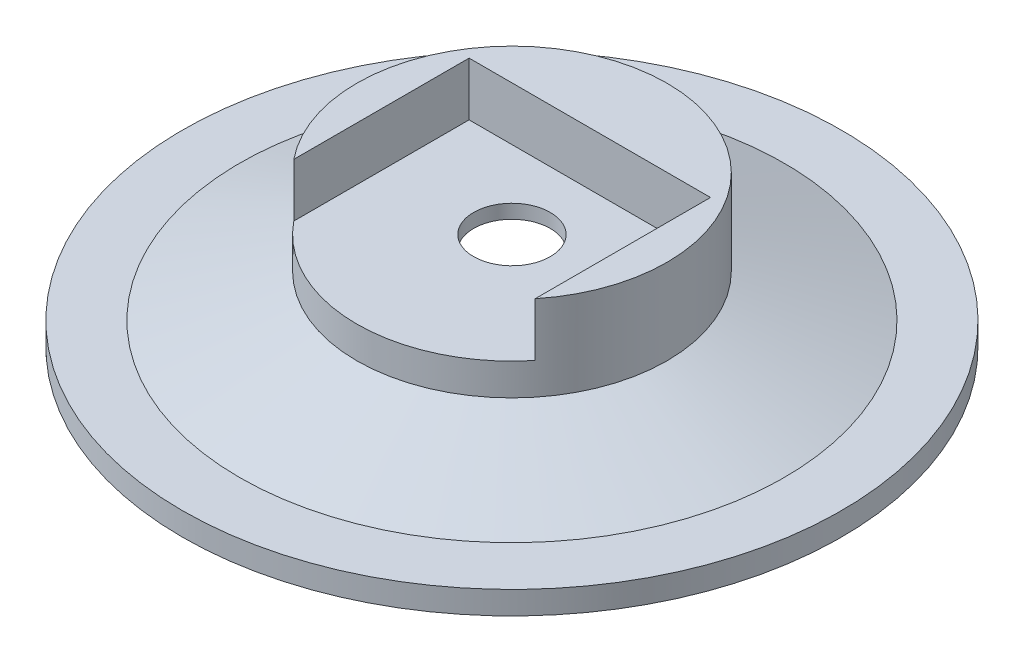
ISO-10303-21;
HEADER;
FILE_DESCRIPTION(('STEP AP214'),'2;1');
FILE_NAME('part.step','',(''),(''),'','','');
FILE_SCHEMA(('AUTOMOTIVE_DESIGN { 1 0 10303 214 1 1 1 1 }'));
ENDSEC;
DATA;
#1=APPLICATION_CONTEXT('core data for automotive mechanical design processes');
#2=APPLICATION_PROTOCOL_DEFINITION('international standard','automotive_design',2000,#1);
#3=PRODUCT_CONTEXT('',#1,'mechanical');
#4=PRODUCT('Part','Part','',(#3));
#5=PRODUCT_RELATED_PRODUCT_CATEGORY('part','',(#4));
#6=PRODUCT_DEFINITION_FORMATION('','',#4);
#7=PRODUCT_DEFINITION_CONTEXT('part definition',#1,'design');
#8=PRODUCT_DEFINITION('design','',#6,#7);
#9=PRODUCT_DEFINITION_SHAPE('','',#8);
#10=(LENGTH_UNIT() NAMED_UNIT(*) SI_UNIT(.MILLI.,.METRE.));
#11=(NAMED_UNIT(*) PLANE_ANGLE_UNIT() SI_UNIT($,.RADIAN.));
#12=(NAMED_UNIT(*) SI_UNIT($,.STERADIAN.) SOLID_ANGLE_UNIT());
#13=UNCERTAINTY_MEASURE_WITH_UNIT(LENGTH_MEASURE(1.E-05),#10,'distance_accuracy_value','');
#14=(GEOMETRIC_REPRESENTATION_CONTEXT(3) GLOBAL_UNCERTAINTY_ASSIGNED_CONTEXT((#13)) GLOBAL_UNIT_ASSIGNED_CONTEXT((#10,
#11,#12)) REPRESENTATION_CONTEXT('',''));
#15=CARTESIAN_POINT('',(0.,0.,0.));
#16=DIRECTION('',(0.,0.,1.));
#17=DIRECTION('',(1.,0.,0.));
#18=AXIS2_PLACEMENT_3D('',#15,#16,#17);
#19=CARTESIAN_POINT('',(0.,0.,0.));
#20=DIRECTION('',(0.,1.,0.));
#21=DIRECTION('',(0.,0.,1.));
#22=AXIS2_PLACEMENT_3D('',#19,#20,#21);
#23=CYLINDRICAL_SURFACE('',#22,2.5);
#24=CARTESIAN_POINT('',(0.,5.44285714285714,0.));
#25=DIRECTION('',(0.,1.,0.));
#26=DIRECTION('',(0.,0.,1.));
#27=AXIS2_PLACEMENT_3D('',#24,#25,#26);
#28=CIRCLE('',#27,2.5);
#29=CARTESIAN_POINT('',(0.,5.44285714285714,2.5));
#30=VERTEX_POINT('',#29);
#31=EDGE_CURVE('E117',#30,#30,#28,.T.);
#32=ORIENTED_EDGE('',*,*,#31,.F.);
#33=EDGE_LOOP('',(#32));
#34=FACE_BOUND('',#33,.T.);
#35=CARTESIAN_POINT('',(0.,6.35,0.));
#36=DIRECTION('',(0.,1.,0.));
#37=DIRECTION('',(0.,0.,1.));
#38=AXIS2_PLACEMENT_3D('',#35,#36,#37);
#39=CIRCLE('',#38,2.5);
#40=CARTESIAN_POINT('',(0.,6.35,2.5));
#41=VERTEX_POINT('',#40);
#42=EDGE_CURVE('E94',#41,#41,#39,.F.);
#43=ORIENTED_EDGE('',*,*,#42,.F.);
#44=EDGE_LOOP('',(#43));
#45=FACE_BOUND('',#44,.T.);
#46=ADVANCED_FACE('F34',(#34,#45),#23,.F.);
#47=CARTESIAN_POINT('',(17.5,0.,0.));
#48=DIRECTION('',(0.,1.,0.));
#49=DIRECTION('',(0.,0.,1.));
#50=AXIS2_PLACEMENT_3D('',#47,#48,#49);
#51=PLANE('',#50);
#52=CARTESIAN_POINT('',(0.,0.,0.));
#53=DIRECTION('',(0.,1.,0.));
#54=DIRECTION('',(0.,0.,1.));
#55=AXIS2_PLACEMENT_3D('',#52,#53,#54);
#56=CIRCLE('',#55,21.5);
#57=CARTESIAN_POINT('',(0.,0.,21.5));
#58=VERTEX_POINT('',#57);
#59=EDGE_CURVE('E102',#58,#58,#56,.T.);
#60=ORIENTED_EDGE('',*,*,#59,.F.);
#61=EDGE_LOOP('',(#60));
#62=FACE_BOUND('',#61,.T.);
#63=CARTESIAN_POINT('',(0.,0.,0.));
#64=DIRECTION('',(0.,1.,0.));
#65=DIRECTION('',(0.,0.,1.));
#66=AXIS2_PLACEMENT_3D('',#63,#64,#65);
#67=CIRCLE('',#66,17.5);
#68=CARTESIAN_POINT('',(0.,0.,17.5));
#69=VERTEX_POINT('',#68);
#70=EDGE_CURVE('E120',#69,#69,#67,.T.);
#71=ORIENTED_EDGE('',*,*,#70,.T.);
#72=EDGE_LOOP('',(#71));
#73=FACE_BOUND('',#72,.T.);
#74=ADVANCED_FACE('F36',(#62,#73),#51,.F.);
#75=CARTESIAN_POINT('',(0.,5.44285714285714,0.));
#76=DIRECTION('',(0.,-1.,0.));
#77=DIRECTION('',(0.,0.,-1.));
#78=AXIS2_PLACEMENT_3D('',#75,#76,#77);
#79=CONICAL_SURFACE('',#78,2.5,1.2227137122716);
#80=ORIENTED_EDGE('',*,*,#70,.F.);
#81=EDGE_LOOP('',(#80));
#82=FACE_BOUND('',#81,.T.);
#83=ORIENTED_EDGE('',*,*,#31,.T.);
#84=EDGE_LOOP('',(#83));
#85=FACE_BOUND('',#84,.T.);
#86=ADVANCED_FACE('F149',(#82,#85),#79,.F.);
#87=CARTESIAN_POINT('',(10.12,9.83949416342413,0.));
#88=DIRECTION('',(0.,-1.,0.));
#89=DIRECTION('',(0.,0.,-1.));
#90=AXIS2_PLACEMENT_3D('',#87,#88,#89);
#91=PLANE('',#90);
#92=DIRECTION('',(1.,0.,0.));
#93=VECTOR('',#92,1.);
#94=CARTESIAN_POINT('',(10.12,9.83949416342413,-5.08));
#95=LINE('',#94,#93);
#96=CARTESIAN_POINT('',(-7.874,9.83949416342413,-5.08));
#97=VERTEX_POINT('',#96);
#98=CARTESIAN_POINT('',(7.874,9.83949416342413,-5.08));
#99=VERTEX_POINT('',#98);
#100=EDGE_CURVE('E11',#97,#99,#95,.T.);
#101=ORIENTED_EDGE('',*,*,#100,.T.);
#102=DIRECTION('',(0.,0.,1.));
#103=VECTOR('',#102,1.);
#104=CARTESIAN_POINT('',(7.874,9.83949416342413,0.));
#105=LINE('',#104,#103);
#106=CARTESIAN_POINT('',(7.874,9.83949416342413,6.3572418547669));
#107=VERTEX_POINT('',#106);
#108=EDGE_CURVE('E85',#99,#107,#105,.T.);
#109=ORIENTED_EDGE('',*,*,#108,.T.);
#110=CARTESIAN_POINT('',(0.,9.83949416342413,0.));
#111=DIRECTION('',(0.,1.,0.));
#112=DIRECTION('',(0.,0.,1.));
#113=AXIS2_PLACEMENT_3D('',#110,#111,#112);
#114=CIRCLE('',#113,10.12);
#115=CARTESIAN_POINT('',(-7.874,9.83949416342413,6.3572418547669));
#116=VERTEX_POINT('',#115);
#117=EDGE_CURVE('E114',#107,#116,#114,.T.);
#118=ORIENTED_EDGE('',*,*,#117,.T.);
#119=DIRECTION('',(0.,0.,-1.));
#120=VECTOR('',#119,1.);
#121=CARTESIAN_POINT('',(-7.874,9.83949416342413,0.));
#122=LINE('',#121,#120);
#123=EDGE_CURVE('E98',#116,#97,#122,.T.);
#124=ORIENTED_EDGE('',*,*,#123,.T.);
#125=EDGE_LOOP('',(#101,#109,#118,#124));
#126=FACE_BOUND('',#125,.T.);
#127=ADVANCED_FACE('F131',(#126),#91,.F.);
#128=CARTESIAN_POINT('',(0.,0.,0.));
#129=DIRECTION('',(0.,1.,0.));
#130=DIRECTION('',(0.,0.,1.));
#131=AXIS2_PLACEMENT_3D('',#128,#129,#130);
#132=CYLINDRICAL_SURFACE('',#131,10.12);
#133=ORIENTED_EDGE('',*,*,#117,.F.);
#134=DIRECTION('',(0.,1.,0.));
#135=VECTOR('',#134,1.);
#136=CARTESIAN_POINT('',(7.874,0.,6.3572418547669));
#137=LINE('',#136,#135);
#138=CARTESIAN_POINT('',(7.874,6.35,6.3572418547669));
#139=VERTEX_POINT('',#138);
#140=EDGE_CURVE('E42',#107,#139,#137,.F.);
#141=ORIENTED_EDGE('',*,*,#140,.T.);
#142=CARTESIAN_POINT('',(0.,6.35,0.));
#143=DIRECTION('',(0.,1.,0.));
#144=DIRECTION('',(0.,0.,1.));
#145=AXIS2_PLACEMENT_3D('',#142,#143,#144);
#146=CIRCLE('',#145,10.12);
#147=CARTESIAN_POINT('',(-7.874,6.35,6.3572418547669));
#148=VERTEX_POINT('',#147);
#149=EDGE_CURVE('E80',#148,#139,#146,.T.);
#150=ORIENTED_EDGE('',*,*,#149,.F.);
#151=DIRECTION('',(0.,1.,0.));
#152=VECTOR('',#151,1.);
#153=CARTESIAN_POINT('',(-7.874,0.,6.3572418547669));
#154=LINE('',#153,#152);
#155=EDGE_CURVE('E124',#148,#116,#154,.T.);
#156=ORIENTED_EDGE('',*,*,#155,.T.);
#157=EDGE_LOOP('',(#133,#141,#150,#156));
#158=FACE_BOUND('',#157,.T.);
#159=CARTESIAN_POINT('',(0.,4.27358209479659,0.));
#160=DIRECTION('',(0.,1.,0.));
#161=DIRECTION('',(0.,0.,1.));
#162=AXIS2_PLACEMENT_3D('',#159,#160,#161);
#163=CIRCLE('',#162,10.12);
#164=CARTESIAN_POINT('',(0.,4.27358209479659,10.12));
#165=VERTEX_POINT('',#164);
#166=EDGE_CURVE('E111',#165,#165,#163,.T.);
#167=ORIENTED_EDGE('',*,*,#166,.T.);
#168=EDGE_LOOP('',(#167));
#169=FACE_BOUND('',#168,.T.);
#170=ADVANCED_FACE('F128',(#158,#169),#132,.T.);
#171=CARTESIAN_POINT('',(0.,1.5,0.));
#172=DIRECTION('',(0.,-1.,0.));
#173=DIRECTION('',(0.,0.,-1.));
#174=AXIS2_PLACEMENT_3D('',#171,#172,#173);
#175=CONICAL_SURFACE('',#174,17.7637301825103,1.2227137122716);
#176=ORIENTED_EDGE('',*,*,#166,.F.);
#177=EDGE_LOOP('',(#176));
#178=FACE_BOUND('',#177,.T.);
#179=CARTESIAN_POINT('',(0.,1.5,0.));
#180=DIRECTION('',(0.,1.,0.));
#181=DIRECTION('',(0.,0.,1.));
#182=AXIS2_PLACEMENT_3D('',#179,#180,#181);
#183=CIRCLE('',#182,17.7637301825103);
#184=CARTESIAN_POINT('',(0.,1.5,17.7637301825103));
#185=VERTEX_POINT('',#184);
#186=EDGE_CURVE('E108',#185,#185,#183,.T.);
#187=ORIENTED_EDGE('',*,*,#186,.T.);
#188=EDGE_LOOP('',(#187));
#189=FACE_BOUND('',#188,.T.);
#190=ADVANCED_FACE('F166',(#178,#189),#175,.T.);
#191=CARTESIAN_POINT('',(17.7637301825103,1.5,0.));
#192=DIRECTION('',(0.,-1.,0.));
#193=DIRECTION('',(0.,0.,-1.));
#194=AXIS2_PLACEMENT_3D('',#191,#192,#193);
#195=PLANE('',#194);
#196=ORIENTED_EDGE('',*,*,#186,.F.);
#197=EDGE_LOOP('',(#196));
#198=FACE_BOUND('',#197,.T.);
#199=CARTESIAN_POINT('',(0.,1.5,0.));
#200=DIRECTION('',(0.,1.,0.));
#201=DIRECTION('',(0.,0.,1.));
#202=AXIS2_PLACEMENT_3D('',#199,#200,#201);
#203=CIRCLE('',#202,21.5);
#204=CARTESIAN_POINT('',(0.,1.5,21.5));
#205=VERTEX_POINT('',#204);
#206=EDGE_CURVE('E105',#205,#205,#203,.T.);
#207=ORIENTED_EDGE('',*,*,#206,.T.);
#208=EDGE_LOOP('',(#207));
#209=FACE_BOUND('',#208,.T.);
#210=ADVANCED_FACE('F170',(#198,#209),#195,.F.);
#211=CARTESIAN_POINT('',(0.,0.,0.));
#212=DIRECTION('',(0.,1.,0.));
#213=DIRECTION('',(0.,0.,1.));
#214=AXIS2_PLACEMENT_3D('',#211,#212,#213);
#215=CYLINDRICAL_SURFACE('',#214,21.5);
#216=ORIENTED_EDGE('',*,*,#206,.F.);
#217=EDGE_LOOP('',(#216));
#218=FACE_BOUND('',#217,.T.);
#219=ORIENTED_EDGE('',*,*,#59,.T.);
#220=EDGE_LOOP('',(#219));
#221=FACE_BOUND('',#220,.T.);
#222=ADVANCED_FACE('F176',(#218,#221),#215,.T.);
#223=CARTESIAN_POINT('',(7.874,6.35,-5.08));
#224=DIRECTION('',(0.,0.,-1.));
#225=DIRECTION('',(-1.,0.,0.));
#226=AXIS2_PLACEMENT_3D('',#223,#224,#225);
#227=PLANE('',#226);
#228=DIRECTION('',(0.,1.,0.));
#229=VECTOR('',#228,1.);
#230=CARTESIAN_POINT('',(-7.874,6.35,-5.08));
#231=LINE('',#230,#229);
#232=CARTESIAN_POINT('',(-7.874,6.35,-5.08));
#233=VERTEX_POINT('',#232);
#234=EDGE_CURVE('E87',#233,#97,#231,.T.);
#235=ORIENTED_EDGE('',*,*,#234,.F.);
#236=DIRECTION('',(-1.,0.,0.));
#237=VECTOR('',#236,1.);
#238=CARTESIAN_POINT('',(7.874,6.35,-5.08));
#239=LINE('',#238,#237);
#240=CARTESIAN_POINT('',(7.874,6.35,-5.08));
#241=VERTEX_POINT('',#240);
#242=EDGE_CURVE('E78',#241,#233,#239,.T.);
#243=ORIENTED_EDGE('',*,*,#242,.F.);
#244=DIRECTION('',(0.,1.,0.));
#245=VECTOR('',#244,1.);
#246=CARTESIAN_POINT('',(7.874,6.35,-5.08));
#247=LINE('',#246,#245);
#248=EDGE_CURVE('E83',#241,#99,#247,.T.);
#249=ORIENTED_EDGE('',*,*,#248,.T.);
#250=ORIENTED_EDGE('',*,*,#100,.F.);
#251=EDGE_LOOP('',(#235,#243,#249,#250));
#252=FACE_BOUND('',#251,.T.);
#253=ADVANCED_FACE('F89',(#252),#227,.F.);
#254=CARTESIAN_POINT('',(7.874,6.35,10.668));
#255=DIRECTION('',(1.,0.,0.));
#256=DIRECTION('',(0.,0.,-1.));
#257=AXIS2_PLACEMENT_3D('',#254,#255,#256);
#258=PLANE('',#257);
#259=ORIENTED_EDGE('',*,*,#248,.F.);
#260=DIRECTION('',(0.,0.,-1.));
#261=VECTOR('',#260,1.);
#262=CARTESIAN_POINT('',(7.874,6.35,10.668));
#263=LINE('',#262,#261);
#264=EDGE_CURVE('E73',#139,#241,#263,.T.);
#265=ORIENTED_EDGE('',*,*,#264,.F.);
#266=ORIENTED_EDGE('',*,*,#140,.F.);
#267=ORIENTED_EDGE('',*,*,#108,.F.);
#268=EDGE_LOOP('',(#259,#265,#266,#267));
#269=FACE_BOUND('',#268,.T.);
#270=ADVANCED_FACE('F84',(#269),#258,.F.);
#271=CARTESIAN_POINT('',(-7.874,6.35,-5.08));
#272=DIRECTION('',(-1.,0.,0.));
#273=DIRECTION('',(0.,0.,1.));
#274=AXIS2_PLACEMENT_3D('',#271,#272,#273);
#275=PLANE('',#274);
#276=ORIENTED_EDGE('',*,*,#155,.F.);
#277=DIRECTION('',(0.,0.,1.));
#278=VECTOR('',#277,1.);
#279=CARTESIAN_POINT('',(-7.874,6.35,-5.08));
#280=LINE('',#279,#278);
#281=EDGE_CURVE('E49',#233,#148,#280,.T.);
#282=ORIENTED_EDGE('',*,*,#281,.F.);
#283=ORIENTED_EDGE('',*,*,#234,.T.);
#284=ORIENTED_EDGE('',*,*,#123,.F.);
#285=EDGE_LOOP('',(#276,#282,#283,#284));
#286=FACE_BOUND('',#285,.T.);
#287=ADVANCED_FACE('F133',(#286),#275,.F.);
#288=CARTESIAN_POINT('',(0.,6.35,0.));
#289=DIRECTION('',(0.,1.,0.));
#290=DIRECTION('',(0.,0.,1.));
#291=AXIS2_PLACEMENT_3D('',#288,#289,#290);
#292=PLANE('',#291);
#293=ORIENTED_EDGE('',*,*,#149,.T.);
#294=ORIENTED_EDGE('',*,*,#264,.T.);
#295=ORIENTED_EDGE('',*,*,#242,.T.);
#296=ORIENTED_EDGE('',*,*,#281,.T.);
#297=EDGE_LOOP('',(#293,#294,#295,#296));
#298=FACE_BOUND('',#297,.T.);
#299=ORIENTED_EDGE('',*,*,#42,.T.);
#300=EDGE_LOOP('',(#299));
#301=FACE_BOUND('',#300,.T.);
#302=ADVANCED_FACE('F75',(#298,#301),#292,.T.);
#303=CLOSED_SHELL('',(#46,#74,#86,#127,#170,#190,#210,#222,#253,#270,#287,#302));
#304=MANIFOLD_SOLID_BREP('B2',#303);
#305=ADVANCED_BREP_SHAPE_REPRESENTATION('',(#18,#304),#14);
#306=SHAPE_DEFINITION_REPRESENTATION(#9,#305);
ENDSEC;
END-ISO-10303-21;
